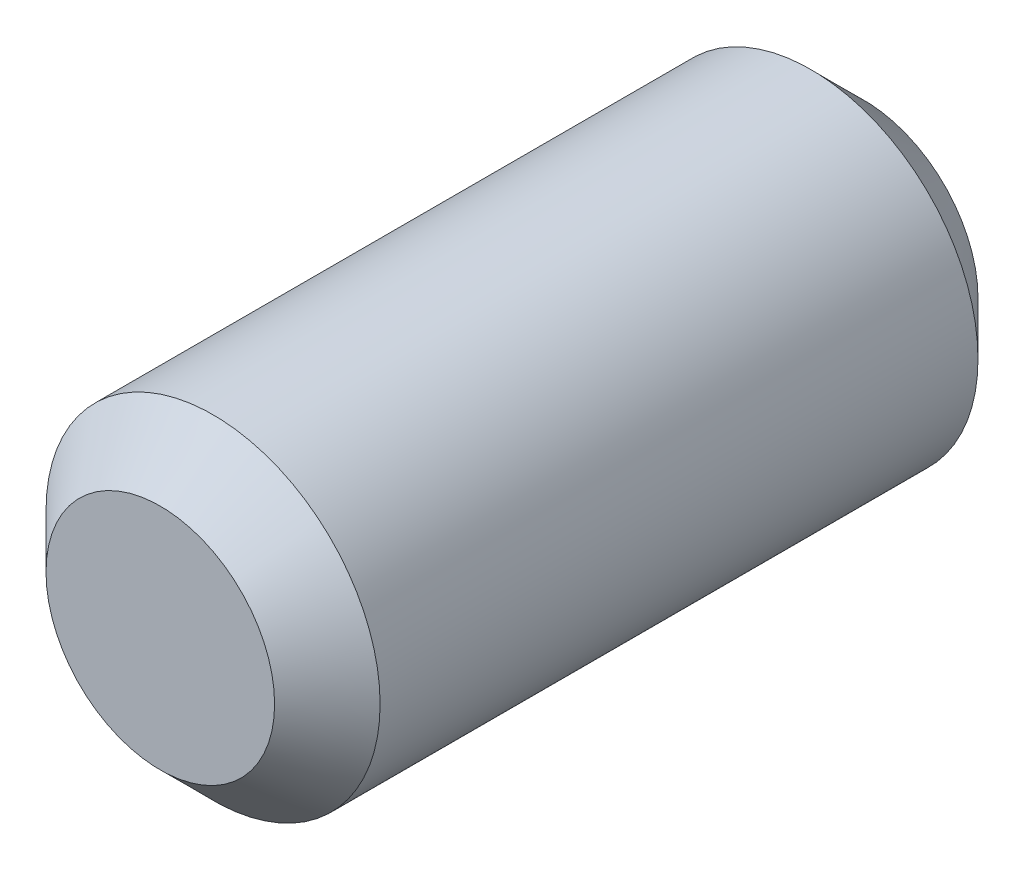
ISO-10303-21;
HEADER;
FILE_DESCRIPTION(('STEP AP214'),'2;1');
FILE_NAME('part.step','',(''),(''),'','','');
FILE_SCHEMA(('AUTOMOTIVE_DESIGN { 1 0 10303 214 1 1 1 1 }'));
ENDSEC;
DATA;
#1=APPLICATION_CONTEXT('core data for automotive mechanical design processes');
#2=APPLICATION_PROTOCOL_DEFINITION('international standard','automotive_design',2000,#1);
#3=PRODUCT_CONTEXT('',#1,'mechanical');
#4=PRODUCT('Part','Part','',(#3));
#5=PRODUCT_RELATED_PRODUCT_CATEGORY('part','',(#4));
#6=PRODUCT_DEFINITION_FORMATION('','',#4);
#7=PRODUCT_DEFINITION_CONTEXT('part definition',#1,'design');
#8=PRODUCT_DEFINITION('design','',#6,#7);
#9=PRODUCT_DEFINITION_SHAPE('','',#8);
#10=(LENGTH_UNIT() NAMED_UNIT(*) SI_UNIT(.MILLI.,.METRE.));
#11=(NAMED_UNIT(*) PLANE_ANGLE_UNIT() SI_UNIT($,.RADIAN.));
#12=(NAMED_UNIT(*) SI_UNIT($,.STERADIAN.) SOLID_ANGLE_UNIT());
#13=UNCERTAINTY_MEASURE_WITH_UNIT(LENGTH_MEASURE(1.E-05),#10,'distance_accuracy_value','');
#14=(GEOMETRIC_REPRESENTATION_CONTEXT(3) GLOBAL_UNCERTAINTY_ASSIGNED_CONTEXT((#13)) GLOBAL_UNIT_ASSIGNED_CONTEXT((#10,
#11,#12)) REPRESENTATION_CONTEXT('',''));
#15=CARTESIAN_POINT('',(0.,0.,0.));
#16=DIRECTION('',(0.,0.,1.));
#17=DIRECTION('',(1.,0.,0.));
#18=AXIS2_PLACEMENT_3D('',#15,#16,#17);
#19=CARTESIAN_POINT('',(0.,0.,16.375));
#20=DIRECTION('',(0.,0.,-1.));
#21=DIRECTION('',(-1.,0.,0.));
#22=AXIS2_PLACEMENT_3D('',#19,#20,#21);
#23=CYLINDRICAL_SURFACE('',#22,3.028125);
#24=CARTESIAN_POINT('',(0.,0.,15.41875));
#25=DIRECTION('',(0.,0.,1.));
#26=DIRECTION('',(1.,0.,0.));
#27=AXIS2_PLACEMENT_3D('',#24,#25,#26);
#28=CIRCLE('',#27,3.028125);
#29=CARTESIAN_POINT('',(3.028125,0.,15.41875));
#30=VERTEX_POINT('',#29);
#31=EDGE_CURVE('E11',#30,#30,#28,.F.);
#32=ORIENTED_EDGE('',*,*,#31,.T.);
#33=EDGE_LOOP('',(#32));
#34=FACE_BOUND('',#33,.T.);
#35=CARTESIAN_POINT('',(0.,0.,4.58125));
#36=DIRECTION('',(0.,0.,1.));
#37=DIRECTION('',(1.,0.,0.));
#38=AXIS2_PLACEMENT_3D('',#35,#36,#37);
#39=CIRCLE('',#38,3.028125);
#40=CARTESIAN_POINT('',(3.028125,0.,4.58125));
#41=VERTEX_POINT('',#40);
#42=EDGE_CURVE('E64',#41,#41,#39,.T.);
#43=ORIENTED_EDGE('',*,*,#42,.T.);
#44=EDGE_LOOP('',(#43));
#45=FACE_BOUND('',#44,.T.);
#46=ADVANCED_FACE('F46',(#34,#45),#23,.T.);
#47=CARTESIAN_POINT('',(0.,0.,16.375));
#48=DIRECTION('',(0.,0.,1.));
#49=DIRECTION('',(1.,0.,0.));
#50=AXIS2_PLACEMENT_3D('',#47,#48,#49);
#51=PLANE('',#50);
#52=CARTESIAN_POINT('',(0.,0.,16.375));
#53=DIRECTION('',(0.,0.,1.));
#54=DIRECTION('',(1.,0.,0.));
#55=AXIS2_PLACEMENT_3D('',#52,#53,#54);
#56=CIRCLE('',#55,2.071875);
#57=CARTESIAN_POINT('',(2.071875,0.,16.375));
#58=VERTEX_POINT('',#57);
#59=EDGE_CURVE('E54',#58,#58,#56,.T.);
#60=ORIENTED_EDGE('',*,*,#59,.T.);
#61=EDGE_LOOP('',(#60));
#62=FACE_BOUND('',#61,.T.);
#63=ADVANCED_FACE('F81',(#62),#51,.T.);
#64=CARTESIAN_POINT('',(0.,0.,3.625));
#65=DIRECTION('',(0.,0.,1.));
#66=DIRECTION('',(1.,0.,0.));
#67=AXIS2_PLACEMENT_3D('',#64,#65,#66);
#68=PLANE('',#67);
#69=CARTESIAN_POINT('',(0.,0.,3.625));
#70=DIRECTION('',(0.,0.,1.));
#71=DIRECTION('',(1.,0.,0.));
#72=AXIS2_PLACEMENT_3D('',#69,#70,#71);
#73=CIRCLE('',#72,2.07187499999999);
#74=CARTESIAN_POINT('',(2.07187499999999,0.,3.625));
#75=VERTEX_POINT('',#74);
#76=EDGE_CURVE('E59',#75,#75,#73,.F.);
#77=ORIENTED_EDGE('',*,*,#76,.T.);
#78=EDGE_LOOP('',(#77));
#79=FACE_BOUND('',#78,.T.);
#80=ADVANCED_FACE('F74',(#79),#68,.F.);
#81=CARTESIAN_POINT('',(0.,0.,4.58125));
#82=DIRECTION('',(0.,0.,1.));
#83=DIRECTION('',(1.,0.,0.));
#84=AXIS2_PLACEMENT_3D('',#81,#82,#83);
#85=CONICAL_SURFACE('',#84,3.028125,0.785398163397451);
#86=ORIENTED_EDGE('',*,*,#76,.F.);
#87=EDGE_LOOP('',(#86));
#88=FACE_BOUND('',#87,.T.);
#89=ORIENTED_EDGE('',*,*,#42,.F.);
#90=EDGE_LOOP('',(#89));
#91=FACE_BOUND('',#90,.T.);
#92=ADVANCED_FACE('F72',(#88,#91),#85,.T.);
#93=CARTESIAN_POINT('',(0.,0.,16.375));
#94=DIRECTION('',(0.,0.,-1.));
#95=DIRECTION('',(-1.,0.,0.));
#96=AXIS2_PLACEMENT_3D('',#93,#94,#95);
#97=CONICAL_SURFACE('',#96,2.071875,0.785398163397447);
#98=ORIENTED_EDGE('',*,*,#31,.F.);
#99=EDGE_LOOP('',(#98));
#100=FACE_BOUND('',#99,.T.);
#101=ORIENTED_EDGE('',*,*,#59,.F.);
#102=EDGE_LOOP('',(#101));
#103=FACE_BOUND('',#102,.T.);
#104=ADVANCED_FACE('F48',(#100,#103),#97,.T.);
#105=CLOSED_SHELL('',(#46,#63,#80,#92,#104));
#106=MANIFOLD_SOLID_BREP('B2',#105);
#107=ADVANCED_BREP_SHAPE_REPRESENTATION('',(#18,#106),#14);
#108=SHAPE_DEFINITION_REPRESENTATION(#9,#107);
ENDSEC;
END-ISO-10303-21;
